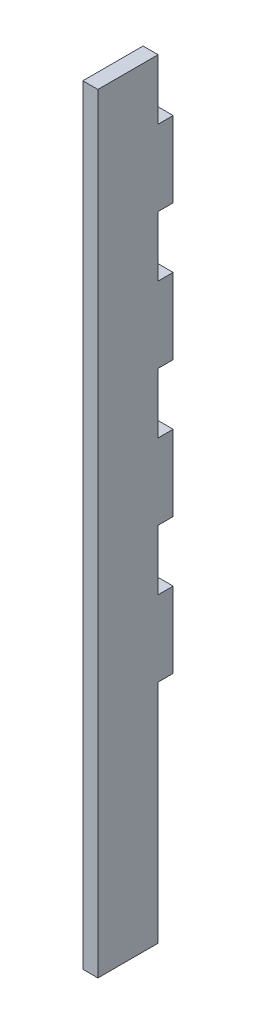
ISO-10303-21;
HEADER;
FILE_DESCRIPTION(('STEP AP214'),'2;1');
FILE_NAME('part.step','',(''),(''),'','','');
FILE_SCHEMA(('AUTOMOTIVE_DESIGN { 1 0 10303 214 1 1 1 1 }'));
ENDSEC;
DATA;
#1=APPLICATION_CONTEXT('core data for automotive mechanical design processes');
#2=APPLICATION_PROTOCOL_DEFINITION('international standard','automotive_design',2000,#1);
#3=PRODUCT_CONTEXT('',#1,'mechanical');
#4=PRODUCT('Part','Part','',(#3));
#5=PRODUCT_RELATED_PRODUCT_CATEGORY('part','',(#4));
#6=PRODUCT_DEFINITION_FORMATION('','',#4);
#7=PRODUCT_DEFINITION_CONTEXT('part definition',#1,'design');
#8=PRODUCT_DEFINITION('design','',#6,#7);
#9=PRODUCT_DEFINITION_SHAPE('','',#8);
#10=(LENGTH_UNIT() NAMED_UNIT(*) SI_UNIT(.MILLI.,.METRE.));
#11=(NAMED_UNIT(*) PLANE_ANGLE_UNIT() SI_UNIT($,.RADIAN.));
#12=(NAMED_UNIT(*) SI_UNIT($,.STERADIAN.) SOLID_ANGLE_UNIT());
#13=UNCERTAINTY_MEASURE_WITH_UNIT(LENGTH_MEASURE(1.E-05),#10,'distance_accuracy_value','');
#14=(GEOMETRIC_REPRESENTATION_CONTEXT(3) GLOBAL_UNCERTAINTY_ASSIGNED_CONTEXT((#13)) GLOBAL_UNIT_ASSIGNED_CONTEXT((#10,
#11,#12)) REPRESENTATION_CONTEXT('',''));
#15=CARTESIAN_POINT('',(0.,0.,0.));
#16=DIRECTION('',(0.,0.,1.));
#17=DIRECTION('',(1.,0.,0.));
#18=AXIS2_PLACEMENT_3D('',#15,#16,#17);
#19=CARTESIAN_POINT('',(3.175,0.,-4.76250000000059));
#20=DIRECTION('',(0.,0.,-1.));
#21=DIRECTION('',(0.,1.,0.));
#22=AXIS2_PLACEMENT_3D('',#19,#20,#21);
#23=PLANE('',#22);
#24=DIRECTION('',(0.,-1.,0.));
#25=VECTOR('',#24,1.);
#26=CARTESIAN_POINT('',(0.,0.,-4.76250000000059));
#27=LINE('',#26,#25);
#28=CARTESIAN_POINT('',(0.,-114.6048,-4.76249999999999));
#29=VERTEX_POINT('',#28);
#30=CARTESIAN_POINT('',(0.,-162.306,-4.76249999999997));
#31=VERTEX_POINT('',#30);
#32=EDGE_CURVE('E201',#29,#31,#27,.T.);
#33=ORIENTED_EDGE('',*,*,#32,.F.);
#34=DIRECTION('',(-1.,0.,0.));
#35=VECTOR('',#34,1.);
#36=CARTESIAN_POINT('',(3.175,-114.6048,-4.76249999999999));
#37=LINE('',#36,#35);
#38=CARTESIAN_POINT('',(3.175,-114.6048,-4.76249999999999));
#39=VERTEX_POINT('',#38);
#40=EDGE_CURVE('E11',#39,#29,#37,.T.);
#41=ORIENTED_EDGE('',*,*,#40,.F.);
#42=DIRECTION('',(0.,-1.,0.));
#43=VECTOR('',#42,1.);
#44=CARTESIAN_POINT('',(3.175,0.,-4.76250000000059));
#45=LINE('',#44,#43);
#46=CARTESIAN_POINT('',(3.175,-162.306,-4.76249999999997));
#47=VERTEX_POINT('',#46);
#48=EDGE_CURVE('E251',#39,#47,#45,.T.);
#49=ORIENTED_EDGE('',*,*,#48,.T.);
#50=DIRECTION('',(-1.,0.,0.));
#51=VECTOR('',#50,1.);
#52=CARTESIAN_POINT('',(3.175,-162.306,-4.76249999999997));
#53=LINE('',#52,#51);
#54=EDGE_CURVE('E123',#47,#31,#53,.T.);
#55=ORIENTED_EDGE('',*,*,#54,.T.);
#56=EDGE_LOOP('',(#33,#41,#49,#55));
#57=FACE_BOUND('',#56,.T.);
#58=ADVANCED_FACE('F37',(#57),#23,.T.);
#59=CARTESIAN_POINT('',(3.175,-114.6048,0.));
#60=DIRECTION('',(0.,-1.,0.));
#61=DIRECTION('',(0.,0.,-1.));
#62=AXIS2_PLACEMENT_3D('',#59,#60,#61);
#63=PLANE('',#62);
#64=DIRECTION('',(0.,0.,1.));
#65=VECTOR('',#64,1.);
#66=CARTESIAN_POINT('',(0.,-114.6048,0.));
#67=LINE('',#66,#65);
#68=CARTESIAN_POINT('',(0.,-114.6048,-7.93750000000001));
#69=VERTEX_POINT('',#68);
#70=EDGE_CURVE('E204',#69,#29,#67,.T.);
#71=ORIENTED_EDGE('',*,*,#70,.F.);
#72=DIRECTION('',(-1.,0.,0.));
#73=VECTOR('',#72,1.);
#74=CARTESIAN_POINT('',(3.175,-114.6048,-7.93750000000001));
#75=LINE('',#74,#73);
#76=CARTESIAN_POINT('',(3.175,-114.6048,-7.93750000000001));
#77=VERTEX_POINT('',#76);
#78=EDGE_CURVE('E45',#77,#69,#75,.T.);
#79=ORIENTED_EDGE('',*,*,#78,.F.);
#80=DIRECTION('',(0.,0.,1.));
#81=VECTOR('',#80,1.);
#82=CARTESIAN_POINT('',(3.175,-114.6048,0.));
#83=LINE('',#82,#81);
#84=EDGE_CURVE('E306',#77,#39,#83,.T.);
#85=ORIENTED_EDGE('',*,*,#84,.T.);
#86=ORIENTED_EDGE('',*,*,#40,.T.);
#87=EDGE_LOOP('',(#71,#79,#85,#86));
#88=FACE_BOUND('',#87,.T.);
#89=ADVANCED_FACE('F292',(#88),#63,.T.);
#90=CARTESIAN_POINT('',(3.175,0.,-7.9375));
#91=DIRECTION('',(0.,0.,-1.));
#92=DIRECTION('',(0.,1.,0.));
#93=AXIS2_PLACEMENT_3D('',#90,#91,#92);
#94=PLANE('',#93);
#95=DIRECTION('',(0.,-1.,0.));
#96=VECTOR('',#95,1.);
#97=CARTESIAN_POINT('',(0.,0.,-7.9375));
#98=LINE('',#97,#96);
#99=CARTESIAN_POINT('',(0.,-98.6536,-7.93750000000001));
#100=VERTEX_POINT('',#99);
#101=EDGE_CURVE('E207',#100,#69,#98,.T.);
#102=ORIENTED_EDGE('',*,*,#101,.F.);
#103=DIRECTION('',(-1.,0.,0.));
#104=VECTOR('',#103,1.);
#105=CARTESIAN_POINT('',(3.175,-98.6536,-7.93750000000001));
#106=LINE('',#105,#104);
#107=CARTESIAN_POINT('',(3.175,-98.6536,-7.93750000000001));
#108=VERTEX_POINT('',#107);
#109=EDGE_CURVE('E281',#108,#100,#106,.T.);
#110=ORIENTED_EDGE('',*,*,#109,.F.);
#111=DIRECTION('',(0.,-1.,0.));
#112=VECTOR('',#111,1.);
#113=CARTESIAN_POINT('',(3.175,0.,-7.9375));
#114=LINE('',#113,#112);
#115=EDGE_CURVE('E288',#108,#77,#114,.T.);
#116=ORIENTED_EDGE('',*,*,#115,.T.);
#117=ORIENTED_EDGE('',*,*,#78,.T.);
#118=EDGE_LOOP('',(#102,#110,#116,#117));
#119=FACE_BOUND('',#118,.T.);
#120=ADVANCED_FACE('F286',(#119),#94,.T.);
#121=CARTESIAN_POINT('',(3.175,-98.6536,0.));
#122=DIRECTION('',(0.,-1.,0.));
#123=DIRECTION('',(0.,0.,-1.));
#124=AXIS2_PLACEMENT_3D('',#121,#122,#123);
#125=PLANE('',#124);
#126=DIRECTION('',(0.,0.,1.));
#127=VECTOR('',#126,1.);
#128=CARTESIAN_POINT('',(0.,-98.6536,0.));
#129=LINE('',#128,#127);
#130=CARTESIAN_POINT('',(0.,-98.6536,-4.76249999999999));
#131=VERTEX_POINT('',#130);
#132=EDGE_CURVE('E210',#100,#131,#129,.T.);
#133=ORIENTED_EDGE('',*,*,#132,.T.);
#134=DIRECTION('',(-1.,0.,0.));
#135=VECTOR('',#134,1.);
#136=CARTESIAN_POINT('',(3.175,-98.6536,-4.76249999999999));
#137=LINE('',#136,#135);
#138=CARTESIAN_POINT('',(3.175,-98.6536,-4.76249999999999));
#139=VERTEX_POINT('',#138);
#140=EDGE_CURVE('E279',#139,#131,#137,.T.);
#141=ORIENTED_EDGE('',*,*,#140,.F.);
#142=DIRECTION('',(0.,0.,1.));
#143=VECTOR('',#142,1.);
#144=CARTESIAN_POINT('',(3.175,-98.6536,0.));
#145=LINE('',#144,#143);
#146=EDGE_CURVE('E302',#108,#139,#145,.T.);
#147=ORIENTED_EDGE('',*,*,#146,.F.);
#148=ORIENTED_EDGE('',*,*,#109,.T.);
#149=EDGE_LOOP('',(#133,#141,#147,#148));
#150=FACE_BOUND('',#149,.T.);
#151=ADVANCED_FACE('F299',(#150),#125,.F.);
#152=CARTESIAN_POINT('',(3.175,0.,-4.7625));
#153=DIRECTION('',(0.,0.,-1.));
#154=DIRECTION('',(0.,1.,0.));
#155=AXIS2_PLACEMENT_3D('',#152,#153,#154);
#156=PLANE('',#155);
#157=DIRECTION('',(0.,-1.,0.));
#158=VECTOR('',#157,1.);
#159=CARTESIAN_POINT('',(0.,0.,-4.7625));
#160=LINE('',#159,#158);
#161=CARTESIAN_POINT('',(0.,-85.9536,-4.76249999999999));
#162=VERTEX_POINT('',#161);
#163=EDGE_CURVE('E215',#162,#131,#160,.T.);
#164=ORIENTED_EDGE('',*,*,#163,.F.);
#165=DIRECTION('',(-1.,0.,0.));
#166=VECTOR('',#165,1.);
#167=CARTESIAN_POINT('',(3.175,-85.9536,-4.76249999999999));
#168=LINE('',#167,#166);
#169=CARTESIAN_POINT('',(3.175,-85.9536,-4.76249999999999));
#170=VERTEX_POINT('',#169);
#171=EDGE_CURVE('E277',#170,#162,#168,.T.);
#172=ORIENTED_EDGE('',*,*,#171,.F.);
#173=DIRECTION('',(0.,-1.,0.));
#174=VECTOR('',#173,1.);
#175=CARTESIAN_POINT('',(3.175,0.,-4.7625));
#176=LINE('',#175,#174);
#177=EDGE_CURVE('E304',#170,#139,#176,.T.);
#178=ORIENTED_EDGE('',*,*,#177,.T.);
#179=ORIENTED_EDGE('',*,*,#140,.T.);
#180=EDGE_LOOP('',(#164,#172,#178,#179));
#181=FACE_BOUND('',#180,.T.);
#182=ADVANCED_FACE('F362',(#181),#156,.T.);
#183=CARTESIAN_POINT('',(3.175,-85.9536,0.));
#184=DIRECTION('',(0.,-1.,0.));
#185=DIRECTION('',(0.,0.,-1.));
#186=AXIS2_PLACEMENT_3D('',#183,#184,#185);
#187=PLANE('',#186);
#188=DIRECTION('',(0.,0.,1.));
#189=VECTOR('',#188,1.);
#190=CARTESIAN_POINT('',(0.,-85.9536,0.));
#191=LINE('',#190,#189);
#192=CARTESIAN_POINT('',(0.,-85.9536,-7.93750000000001));
#193=VERTEX_POINT('',#192);
#194=EDGE_CURVE('E218',#193,#162,#191,.T.);
#195=ORIENTED_EDGE('',*,*,#194,.F.);
#196=DIRECTION('',(-1.,0.,0.));
#197=VECTOR('',#196,1.);
#198=CARTESIAN_POINT('',(3.175,-85.9536,-7.93750000000001));
#199=LINE('',#198,#197);
#200=CARTESIAN_POINT('',(3.175,-85.9536,-7.93750000000001));
#201=VERTEX_POINT('',#200);
#202=EDGE_CURVE('E275',#201,#193,#199,.T.);
#203=ORIENTED_EDGE('',*,*,#202,.F.);
#204=DIRECTION('',(0.,0.,1.));
#205=VECTOR('',#204,1.);
#206=CARTESIAN_POINT('',(3.175,-85.9536,0.));
#207=LINE('',#206,#205);
#208=EDGE_CURVE('E317',#201,#170,#207,.T.);
#209=ORIENTED_EDGE('',*,*,#208,.T.);
#210=ORIENTED_EDGE('',*,*,#171,.T.);
#211=EDGE_LOOP('',(#195,#203,#209,#210));
#212=FACE_BOUND('',#211,.T.);
#213=ADVANCED_FACE('F365',(#212),#187,.T.);
#214=CARTESIAN_POINT('',(0.,-70.0024,-7.93750000000001));
#215=VERTEX_POINT('',#214);
#216=EDGE_CURVE('E212',#215,#193,#98,.T.);
#217=ORIENTED_EDGE('',*,*,#216,.F.);
#218=DIRECTION('',(-1.,0.,0.));
#219=VECTOR('',#218,1.);
#220=CARTESIAN_POINT('',(3.175,-70.0024,-7.93750000000001));
#221=LINE('',#220,#219);
#222=CARTESIAN_POINT('',(3.175,-70.0024,-7.93750000000001));
#223=VERTEX_POINT('',#222);
#224=EDGE_CURVE('E273',#223,#215,#221,.T.);
#225=ORIENTED_EDGE('',*,*,#224,.F.);
#226=EDGE_CURVE('E309',#223,#201,#114,.T.);
#227=ORIENTED_EDGE('',*,*,#226,.T.);
#228=ORIENTED_EDGE('',*,*,#202,.T.);
#229=EDGE_LOOP('',(#217,#225,#227,#228));
#230=FACE_BOUND('',#229,.T.);
#231=ADVANCED_FACE('F357',(#230),#94,.T.);
#232=CARTESIAN_POINT('',(3.175,-70.0024,0.));
#233=DIRECTION('',(0.,-1.,0.));
#234=DIRECTION('',(0.,0.,-1.));
#235=AXIS2_PLACEMENT_3D('',#232,#233,#234);
#236=PLANE('',#235);
#237=DIRECTION('',(0.,0.,1.));
#238=VECTOR('',#237,1.);
#239=CARTESIAN_POINT('',(0.,-70.0024,0.));
#240=LINE('',#239,#238);
#241=CARTESIAN_POINT('',(0.,-70.0024,-4.76249999999999));
#242=VERTEX_POINT('',#241);
#243=EDGE_CURVE('E221',#215,#242,#240,.T.);
#244=ORIENTED_EDGE('',*,*,#243,.T.);
#245=DIRECTION('',(-1.,0.,0.));
#246=VECTOR('',#245,1.);
#247=CARTESIAN_POINT('',(3.175,-70.0024,-4.76249999999999));
#248=LINE('',#247,#246);
#249=CARTESIAN_POINT('',(3.175,-70.0024,-4.76249999999999));
#250=VERTEX_POINT('',#249);
#251=EDGE_CURVE('E271',#250,#242,#248,.T.);
#252=ORIENTED_EDGE('',*,*,#251,.F.);
#253=DIRECTION('',(0.,0.,1.));
#254=VECTOR('',#253,1.);
#255=CARTESIAN_POINT('',(3.175,-70.0024,0.));
#256=LINE('',#255,#254);
#257=EDGE_CURVE('E316',#223,#250,#256,.T.);
#258=ORIENTED_EDGE('',*,*,#257,.F.);
#259=ORIENTED_EDGE('',*,*,#224,.T.);
#260=EDGE_LOOP('',(#244,#252,#258,#259));
#261=FACE_BOUND('',#260,.T.);
#262=ADVANCED_FACE('F370',(#261),#236,.F.);
#263=CARTESIAN_POINT('',(3.175,0.,-4.7625));
#264=DIRECTION('',(0.,0.,-1.));
#265=DIRECTION('',(0.,1.,0.));
#266=AXIS2_PLACEMENT_3D('',#263,#264,#265);
#267=PLANE('',#266);
#268=DIRECTION('',(0.,-1.,0.));
#269=VECTOR('',#268,1.);
#270=CARTESIAN_POINT('',(0.,0.,-4.7625));
#271=LINE('',#270,#269);
#272=CARTESIAN_POINT('',(0.,-57.3024,-4.7625));
#273=VERTEX_POINT('',#272);
#274=EDGE_CURVE('E224',#273,#242,#271,.T.);
#275=ORIENTED_EDGE('',*,*,#274,.F.);
#276=DIRECTION('',(-1.,0.,0.));
#277=VECTOR('',#276,1.);
#278=CARTESIAN_POINT('',(3.175,-57.3024,-4.7625));
#279=LINE('',#278,#277);
#280=CARTESIAN_POINT('',(3.175,-57.3024,-4.7625));
#281=VERTEX_POINT('',#280);
#282=EDGE_CURVE('E269',#281,#273,#279,.T.);
#283=ORIENTED_EDGE('',*,*,#282,.F.);
#284=DIRECTION('',(0.,-1.,0.));
#285=VECTOR('',#284,1.);
#286=CARTESIAN_POINT('',(3.175,0.,-4.7625));
#287=LINE('',#286,#285);
#288=EDGE_CURVE('E320',#281,#250,#287,.T.);
#289=ORIENTED_EDGE('',*,*,#288,.T.);
#290=ORIENTED_EDGE('',*,*,#251,.T.);
#291=EDGE_LOOP('',(#275,#283,#289,#290));
#292=FACE_BOUND('',#291,.T.);
#293=ADVANCED_FACE('F373',(#292),#267,.T.);
#294=CARTESIAN_POINT('',(3.175,-57.3024,0.));
#295=DIRECTION('',(0.,-1.,0.));
#296=DIRECTION('',(0.,0.,-1.));
#297=AXIS2_PLACEMENT_3D('',#294,#295,#296);
#298=PLANE('',#297);
#299=DIRECTION('',(0.,0.,1.));
#300=VECTOR('',#299,1.);
#301=CARTESIAN_POINT('',(0.,-57.3024,0.));
#302=LINE('',#301,#300);
#303=CARTESIAN_POINT('',(0.,-57.3024,-7.9375));
#304=VERTEX_POINT('',#303);
#305=EDGE_CURVE('E227',#304,#273,#302,.T.);
#306=ORIENTED_EDGE('',*,*,#305,.F.);
#307=DIRECTION('',(-1.,0.,0.));
#308=VECTOR('',#307,1.);
#309=CARTESIAN_POINT('',(3.175,-57.3024,-7.9375));
#310=LINE('',#309,#308);
#311=CARTESIAN_POINT('',(3.175,-57.3024,-7.9375));
#312=VERTEX_POINT('',#311);
#313=EDGE_CURVE('E267',#312,#304,#310,.T.);
#314=ORIENTED_EDGE('',*,*,#313,.F.);
#315=DIRECTION('',(0.,0.,1.));
#316=VECTOR('',#315,1.);
#317=CARTESIAN_POINT('',(3.175,-57.3024,0.));
#318=LINE('',#317,#316);
#319=EDGE_CURVE('E326',#312,#281,#318,.T.);
#320=ORIENTED_EDGE('',*,*,#319,.T.);
#321=ORIENTED_EDGE('',*,*,#282,.T.);
#322=EDGE_LOOP('',(#306,#314,#320,#321));
#323=FACE_BOUND('',#322,.T.);
#324=ADVANCED_FACE('F377',(#323),#298,.T.);
#325=CARTESIAN_POINT('',(0.,-41.3512,-7.9375));
#326=VERTEX_POINT('',#325);
#327=EDGE_CURVE('E230',#326,#304,#98,.T.);
#328=ORIENTED_EDGE('',*,*,#327,.F.);
#329=DIRECTION('',(-1.,0.,0.));
#330=VECTOR('',#329,1.);
#331=CARTESIAN_POINT('',(3.175,-41.3512,-7.9375));
#332=LINE('',#331,#330);
#333=CARTESIAN_POINT('',(3.175,-41.3512,-7.9375));
#334=VERTEX_POINT('',#333);
#335=EDGE_CURVE('E265',#334,#326,#332,.T.);
#336=ORIENTED_EDGE('',*,*,#335,.F.);
#337=EDGE_CURVE('E314',#334,#312,#114,.T.);
#338=ORIENTED_EDGE('',*,*,#337,.T.);
#339=ORIENTED_EDGE('',*,*,#313,.T.);
#340=EDGE_LOOP('',(#328,#336,#338,#339));
#341=FACE_BOUND('',#340,.T.);
#342=ADVANCED_FACE('F381',(#341),#94,.T.);
#343=CARTESIAN_POINT('',(3.175,-41.3512,0.));
#344=DIRECTION('',(0.,-1.,0.));
#345=DIRECTION('',(0.,0.,-1.));
#346=AXIS2_PLACEMENT_3D('',#343,#344,#345);
#347=PLANE('',#346);
#348=DIRECTION('',(0.,0.,1.));
#349=VECTOR('',#348,1.);
#350=CARTESIAN_POINT('',(0.,-41.3512,0.));
#351=LINE('',#350,#349);
#352=CARTESIAN_POINT('',(0.,-41.3512,-4.7625));
#353=VERTEX_POINT('',#352);
#354=EDGE_CURVE('E231',#326,#353,#351,.T.);
#355=ORIENTED_EDGE('',*,*,#354,.T.);
#356=DIRECTION('',(-1.,0.,0.));
#357=VECTOR('',#356,1.);
#358=CARTESIAN_POINT('',(3.175,-41.3512,-4.7625));
#359=LINE('',#358,#357);
#360=CARTESIAN_POINT('',(3.175,-41.3512,-4.7625));
#361=VERTEX_POINT('',#360);
#362=EDGE_CURVE('E263',#361,#353,#359,.T.);
#363=ORIENTED_EDGE('',*,*,#362,.F.);
#364=DIRECTION('',(0.,0.,1.));
#365=VECTOR('',#364,1.);
#366=CARTESIAN_POINT('',(3.175,-41.3512,0.));
#367=LINE('',#366,#365);
#368=EDGE_CURVE('E325',#334,#361,#367,.T.);
#369=ORIENTED_EDGE('',*,*,#368,.F.);
#370=ORIENTED_EDGE('',*,*,#335,.T.);
#371=EDGE_LOOP('',(#355,#363,#369,#370));
#372=FACE_BOUND('',#371,.T.);
#373=ADVANCED_FACE('F382',(#372),#347,.F.);
#374=CARTESIAN_POINT('',(3.175,0.,-4.7625));
#375=DIRECTION('',(0.,0.,-1.));
#376=DIRECTION('',(-1.,0.,0.));
#377=AXIS2_PLACEMENT_3D('',#374,#375,#376);
#378=PLANE('',#377);
#379=DIRECTION('',(0.,-1.,0.));
#380=VECTOR('',#379,1.);
#381=CARTESIAN_POINT('',(0.,0.,-4.7625));
#382=LINE('',#381,#380);
#383=CARTESIAN_POINT('',(0.,-28.6512,-4.7625));
#384=VERTEX_POINT('',#383);
#385=EDGE_CURVE('E234',#384,#353,#382,.T.);
#386=ORIENTED_EDGE('',*,*,#385,.F.);
#387=DIRECTION('',(-1.,0.,0.));
#388=VECTOR('',#387,1.);
#389=CARTESIAN_POINT('',(3.175,-28.6512,-4.7625));
#390=LINE('',#389,#388);
#391=CARTESIAN_POINT('',(3.175,-28.6512,-4.7625));
#392=VERTEX_POINT('',#391);
#393=EDGE_CURVE('E261',#392,#384,#390,.T.);
#394=ORIENTED_EDGE('',*,*,#393,.F.);
#395=DIRECTION('',(0.,-1.,0.));
#396=VECTOR('',#395,1.);
#397=CARTESIAN_POINT('',(3.175,0.,-4.7625));
#398=LINE('',#397,#396);
#399=EDGE_CURVE('E329',#392,#361,#398,.T.);
#400=ORIENTED_EDGE('',*,*,#399,.T.);
#401=ORIENTED_EDGE('',*,*,#362,.T.);
#402=EDGE_LOOP('',(#386,#394,#400,#401));
#403=FACE_BOUND('',#402,.T.);
#404=ADVANCED_FACE('F385',(#403),#378,.T.);
#405=CARTESIAN_POINT('',(3.175,-28.6512,0.));
#406=DIRECTION('',(0.,-1.,0.));
#407=DIRECTION('',(0.,0.,-1.));
#408=AXIS2_PLACEMENT_3D('',#405,#406,#407);
#409=PLANE('',#408);
#410=DIRECTION('',(0.,0.,1.));
#411=VECTOR('',#410,1.);
#412=CARTESIAN_POINT('',(0.,-28.6512,0.));
#413=LINE('',#412,#411);
#414=CARTESIAN_POINT('',(0.,-28.6512,-7.9375));
#415=VERTEX_POINT('',#414);
#416=EDGE_CURVE('E237',#415,#384,#413,.T.);
#417=ORIENTED_EDGE('',*,*,#416,.F.);
#418=DIRECTION('',(-1.,0.,0.));
#419=VECTOR('',#418,1.);
#420=CARTESIAN_POINT('',(3.175,-28.6512,-7.9375));
#421=LINE('',#420,#419);
#422=CARTESIAN_POINT('',(3.175,-28.6512,-7.9375));
#423=VERTEX_POINT('',#422);
#424=EDGE_CURVE('E259',#423,#415,#421,.T.);
#425=ORIENTED_EDGE('',*,*,#424,.F.);
#426=DIRECTION('',(0.,0.,1.));
#427=VECTOR('',#426,1.);
#428=CARTESIAN_POINT('',(3.175,-28.6512,0.));
#429=LINE('',#428,#427);
#430=EDGE_CURVE('E313',#423,#392,#429,.T.);
#431=ORIENTED_EDGE('',*,*,#430,.T.);
#432=ORIENTED_EDGE('',*,*,#393,.T.);
#433=EDGE_LOOP('',(#417,#425,#431,#432));
#434=FACE_BOUND('',#433,.T.);
#435=ADVANCED_FACE('F389',(#434),#409,.T.);
#436=CARTESIAN_POINT('',(0.,-12.7,-7.9375));
#437=VERTEX_POINT('',#436);
#438=EDGE_CURVE('E211',#437,#415,#98,.T.);
#439=ORIENTED_EDGE('',*,*,#438,.F.);
#440=DIRECTION('',(-1.,0.,0.));
#441=VECTOR('',#440,1.);
#442=CARTESIAN_POINT('',(3.175,-12.7,-7.9375));
#443=LINE('',#442,#441);
#444=CARTESIAN_POINT('',(3.175,-12.7,-7.9375));
#445=VERTEX_POINT('',#444);
#446=EDGE_CURVE('E257',#445,#437,#443,.T.);
#447=ORIENTED_EDGE('',*,*,#446,.F.);
#448=EDGE_CURVE('E308',#445,#423,#114,.T.);
#449=ORIENTED_EDGE('',*,*,#448,.T.);
#450=ORIENTED_EDGE('',*,*,#424,.T.);
#451=EDGE_LOOP('',(#439,#447,#449,#450));
#452=FACE_BOUND('',#451,.T.);
#453=ADVANCED_FACE('F358',(#452),#94,.T.);
#454=CARTESIAN_POINT('',(3.175,-12.7,0.));
#455=DIRECTION('',(0.,-1.,0.));
#456=DIRECTION('',(0.,0.,-1.));
#457=AXIS2_PLACEMENT_3D('',#454,#455,#456);
#458=PLANE('',#457);
#459=DIRECTION('',(0.,0.,1.));
#460=VECTOR('',#459,1.);
#461=CARTESIAN_POINT('',(0.,-12.7,0.));
#462=LINE('',#461,#460);
#463=CARTESIAN_POINT('',(0.,-12.7,-4.7625));
#464=VERTEX_POINT('',#463);
#465=EDGE_CURVE('E240',#437,#464,#462,.T.);
#466=ORIENTED_EDGE('',*,*,#465,.T.);
#467=DIRECTION('',(-1.,0.,0.));
#468=VECTOR('',#467,1.);
#469=CARTESIAN_POINT('',(3.175,-12.7,-4.7625));
#470=LINE('',#469,#468);
#471=CARTESIAN_POINT('',(3.175,-12.7,-4.7625));
#472=VERTEX_POINT('',#471);
#473=EDGE_CURVE('E255',#472,#464,#470,.T.);
#474=ORIENTED_EDGE('',*,*,#473,.F.);
#475=DIRECTION('',(0.,0.,1.));
#476=VECTOR('',#475,1.);
#477=CARTESIAN_POINT('',(3.175,-12.7,0.));
#478=LINE('',#477,#476);
#479=EDGE_CURVE('E312',#445,#472,#478,.T.);
#480=ORIENTED_EDGE('',*,*,#479,.F.);
#481=ORIENTED_EDGE('',*,*,#446,.T.);
#482=EDGE_LOOP('',(#466,#474,#480,#481));
#483=FACE_BOUND('',#482,.T.);
#484=ADVANCED_FACE('F395',(#483),#458,.F.);
#485=CARTESIAN_POINT('',(3.175,0.,-4.7625));
#486=DIRECTION('',(0.,0.,-1.));
#487=DIRECTION('',(-1.,0.,0.));
#488=AXIS2_PLACEMENT_3D('',#485,#486,#487);
#489=PLANE('',#488);
#490=DIRECTION('',(0.,-1.,0.));
#491=VECTOR('',#490,1.);
#492=CARTESIAN_POINT('',(0.,0.,-4.7625));
#493=LINE('',#492,#491);
#494=CARTESIAN_POINT('',(0.,0.,-4.7625));
#495=VERTEX_POINT('',#494);
#496=EDGE_CURVE('E243',#495,#464,#493,.T.);
#497=ORIENTED_EDGE('',*,*,#496,.F.);
#498=DIRECTION('',(-1.,0.,0.));
#499=VECTOR('',#498,1.);
#500=CARTESIAN_POINT('',(3.175,0.,-4.7625));
#501=LINE('',#500,#499);
#502=CARTESIAN_POINT('',(3.175,0.,-4.7625));
#503=VERTEX_POINT('',#502);
#504=EDGE_CURVE('E194',#503,#495,#501,.T.);
#505=ORIENTED_EDGE('',*,*,#504,.F.);
#506=DIRECTION('',(0.,-1.,0.));
#507=VECTOR('',#506,1.);
#508=CARTESIAN_POINT('',(3.175,0.,-4.7625));
#509=LINE('',#508,#507);
#510=EDGE_CURVE('E183',#503,#472,#509,.T.);
#511=ORIENTED_EDGE('',*,*,#510,.T.);
#512=ORIENTED_EDGE('',*,*,#473,.T.);
#513=EDGE_LOOP('',(#497,#505,#511,#512));
#514=FACE_BOUND('',#513,.T.);
#515=ADVANCED_FACE('F344',(#514),#489,.T.);
#516=CARTESIAN_POINT('',(3.175,0.,0.));
#517=DIRECTION('',(0.,-1.,0.));
#518=DIRECTION('',(0.,0.,-1.));
#519=AXIS2_PLACEMENT_3D('',#516,#517,#518);
#520=PLANE('',#519);
#521=DIRECTION('',(0.,0.,1.));
#522=VECTOR('',#521,1.);
#523=CARTESIAN_POINT('',(0.,0.,0.));
#524=LINE('',#523,#522);
#525=CARTESIAN_POINT('',(0.,0.,7.9375));
#526=VERTEX_POINT('',#525);
#527=EDGE_CURVE('E190',#495,#526,#524,.T.);
#528=ORIENTED_EDGE('',*,*,#527,.T.);
#529=DIRECTION('',(-1.,0.,0.));
#530=VECTOR('',#529,1.);
#531=CARTESIAN_POINT('',(3.175,0.,7.9375));
#532=LINE('',#531,#530);
#533=CARTESIAN_POINT('',(3.175,0.,7.9375));
#534=VERTEX_POINT('',#533);
#535=EDGE_CURVE('E187',#534,#526,#532,.T.);
#536=ORIENTED_EDGE('',*,*,#535,.F.);
#537=DIRECTION('',(0.,0.,1.));
#538=VECTOR('',#537,1.);
#539=CARTESIAN_POINT('',(3.175,0.,0.));
#540=LINE('',#539,#538);
#541=EDGE_CURVE('E177',#503,#534,#540,.T.);
#542=ORIENTED_EDGE('',*,*,#541,.F.);
#543=ORIENTED_EDGE('',*,*,#504,.T.);
#544=EDGE_LOOP('',(#528,#536,#542,#543));
#545=FACE_BOUND('',#544,.T.);
#546=ADVANCED_FACE('F188',(#545),#520,.F.);
#547=CARTESIAN_POINT('',(3.175,0.,7.9375));
#548=DIRECTION('',(0.,0.,1.));
#549=DIRECTION('',(0.,-1.,0.));
#550=AXIS2_PLACEMENT_3D('',#547,#548,#549);
#551=PLANE('',#550);
#552=DIRECTION('',(0.,1.,0.));
#553=VECTOR('',#552,1.);
#554=CARTESIAN_POINT('',(0.,0.,7.9375));
#555=LINE('',#554,#553);
#556=CARTESIAN_POINT('',(0.,-162.306,7.93750000000001));
#557=VERTEX_POINT('',#556);
#558=EDGE_CURVE('E247',#557,#526,#555,.T.);
#559=ORIENTED_EDGE('',*,*,#558,.F.);
#560=DIRECTION('',(-1.,0.,0.));
#561=VECTOR('',#560,1.);
#562=CARTESIAN_POINT('',(3.175,-162.306,7.93750000000001));
#563=LINE('',#562,#561);
#564=CARTESIAN_POINT('',(3.175,-162.306,7.93750000000001));
#565=VERTEX_POINT('',#564);
#566=EDGE_CURVE('E116',#565,#557,#563,.T.);
#567=ORIENTED_EDGE('',*,*,#566,.F.);
#568=DIRECTION('',(0.,1.,0.));
#569=VECTOR('',#568,1.);
#570=CARTESIAN_POINT('',(3.175,0.,7.9375));
#571=LINE('',#570,#569);
#572=EDGE_CURVE('E181',#565,#534,#571,.T.);
#573=ORIENTED_EDGE('',*,*,#572,.T.);
#574=ORIENTED_EDGE('',*,*,#535,.T.);
#575=EDGE_LOOP('',(#559,#567,#573,#574));
#576=FACE_BOUND('',#575,.T.);
#577=ADVANCED_FACE('F196',(#576),#551,.T.);
#578=CARTESIAN_POINT('',(3.175,-162.306,0.));
#579=DIRECTION('',(0.,1.,0.));
#580=DIRECTION('',(0.,0.,1.));
#581=AXIS2_PLACEMENT_3D('',#578,#579,#580);
#582=PLANE('',#581);
#583=DIRECTION('',(0.,0.,-1.));
#584=VECTOR('',#583,1.);
#585=CARTESIAN_POINT('',(0.,-162.306,0.));
#586=LINE('',#585,#584);
#587=EDGE_CURVE('E249',#557,#31,#586,.T.);
#588=ORIENTED_EDGE('',*,*,#587,.T.);
#589=ORIENTED_EDGE('',*,*,#54,.F.);
#590=DIRECTION('',(0.,0.,-1.));
#591=VECTOR('',#590,1.);
#592=CARTESIAN_POINT('',(3.175,-162.306,0.));
#593=LINE('',#592,#591);
#594=EDGE_CURVE('E53',#565,#47,#593,.T.);
#595=ORIENTED_EDGE('',*,*,#594,.F.);
#596=ORIENTED_EDGE('',*,*,#566,.T.);
#597=EDGE_LOOP('',(#588,#589,#595,#596));
#598=FACE_BOUND('',#597,.T.);
#599=ADVANCED_FACE('F347',(#598),#582,.F.);
#600=CARTESIAN_POINT('',(3.175,0.,0.));
#601=DIRECTION('',(1.,0.,0.));
#602=DIRECTION('',(0.,0.,-1.));
#603=AXIS2_PLACEMENT_3D('',#600,#601,#602);
#604=PLANE('',#603);
#605=ORIENTED_EDGE('',*,*,#48,.F.);
#606=ORIENTED_EDGE('',*,*,#84,.F.);
#607=ORIENTED_EDGE('',*,*,#115,.F.);
#608=ORIENTED_EDGE('',*,*,#146,.T.);
#609=ORIENTED_EDGE('',*,*,#177,.F.);
#610=ORIENTED_EDGE('',*,*,#208,.F.);
#611=ORIENTED_EDGE('',*,*,#226,.F.);
#612=ORIENTED_EDGE('',*,*,#257,.T.);
#613=ORIENTED_EDGE('',*,*,#288,.F.);
#614=ORIENTED_EDGE('',*,*,#319,.F.);
#615=ORIENTED_EDGE('',*,*,#337,.F.);
#616=ORIENTED_EDGE('',*,*,#368,.T.);
#617=ORIENTED_EDGE('',*,*,#399,.F.);
#618=ORIENTED_EDGE('',*,*,#430,.F.);
#619=ORIENTED_EDGE('',*,*,#448,.F.);
#620=ORIENTED_EDGE('',*,*,#479,.T.);
#621=ORIENTED_EDGE('',*,*,#510,.F.);
#622=ORIENTED_EDGE('',*,*,#541,.T.);
#623=ORIENTED_EDGE('',*,*,#572,.F.);
#624=ORIENTED_EDGE('',*,*,#594,.T.);
#625=EDGE_LOOP('',(#605,#606,#607,#608,#609,#610,#611,#612,#613,#614,#615,#616,#617,#618,#619,
#620,#621,#622,#623,#624));
#626=FACE_BOUND('',#625,.T.);
#627=ADVANCED_FACE('F179',(#626),#604,.T.);
#628=CARTESIAN_POINT('',(0.,0.,0.));
#629=DIRECTION('',(1.,0.,0.));
#630=DIRECTION('',(0.,0.,-1.));
#631=AXIS2_PLACEMENT_3D('',#628,#629,#630);
#632=PLANE('',#631);
#633=ORIENTED_EDGE('',*,*,#32,.T.);
#634=ORIENTED_EDGE('',*,*,#587,.F.);
#635=ORIENTED_EDGE('',*,*,#558,.T.);
#636=ORIENTED_EDGE('',*,*,#527,.F.);
#637=ORIENTED_EDGE('',*,*,#496,.T.);
#638=ORIENTED_EDGE('',*,*,#465,.F.);
#639=ORIENTED_EDGE('',*,*,#438,.T.);
#640=ORIENTED_EDGE('',*,*,#416,.T.);
#641=ORIENTED_EDGE('',*,*,#385,.T.);
#642=ORIENTED_EDGE('',*,*,#354,.F.);
#643=ORIENTED_EDGE('',*,*,#327,.T.);
#644=ORIENTED_EDGE('',*,*,#305,.T.);
#645=ORIENTED_EDGE('',*,*,#274,.T.);
#646=ORIENTED_EDGE('',*,*,#243,.F.);
#647=ORIENTED_EDGE('',*,*,#216,.T.);
#648=ORIENTED_EDGE('',*,*,#194,.T.);
#649=ORIENTED_EDGE('',*,*,#163,.T.);
#650=ORIENTED_EDGE('',*,*,#132,.F.);
#651=ORIENTED_EDGE('',*,*,#101,.T.);
#652=ORIENTED_EDGE('',*,*,#70,.T.);
#653=EDGE_LOOP('',(#633,#634,#635,#636,#637,#638,#639,#640,#641,#642,#643,#644,#645,#646,#647,
#648,#649,#650,#651,#652));
#654=FACE_BOUND('',#653,.T.);
#655=ADVANCED_FACE('F295',(#654),#632,.F.);
#656=CLOSED_SHELL('',(#58,#89,#120,#151,#182,#213,#231,#262,#293,#324,#342,#373,#404,#435,#453,
#484,#515,#546,#577,#599,#627,#655));
#657=MANIFOLD_SOLID_BREP('B2',#656);
#658=ADVANCED_BREP_SHAPE_REPRESENTATION('',(#18,#657),#14);
#659=SHAPE_DEFINITION_REPRESENTATION(#9,#658);
ENDSEC;
END-ISO-10303-21;
